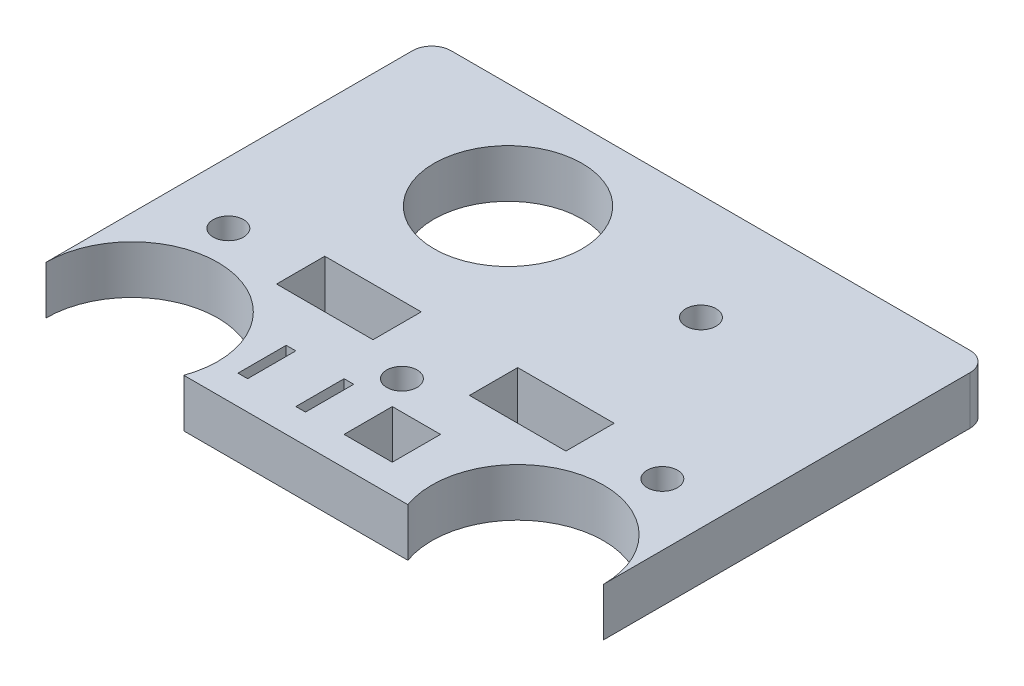
ISO-10303-21;
HEADER;
FILE_DESCRIPTION(('STEP AP214'),'2;1');
FILE_NAME('part.step','',(''),(''),'','','');
FILE_SCHEMA(('AUTOMOTIVE_DESIGN { 1 0 10303 214 1 1 1 1 }'));
ENDSEC;
DATA;
#1=APPLICATION_CONTEXT('core data for automotive mechanical design processes');
#2=APPLICATION_PROTOCOL_DEFINITION('international standard','automotive_design',2000,#1);
#3=PRODUCT_CONTEXT('',#1,'mechanical');
#4=PRODUCT('Part','Part','',(#3));
#5=PRODUCT_RELATED_PRODUCT_CATEGORY('part','',(#4));
#6=PRODUCT_DEFINITION_FORMATION('','',#4);
#7=PRODUCT_DEFINITION_CONTEXT('part definition',#1,'design');
#8=PRODUCT_DEFINITION('design','',#6,#7);
#9=PRODUCT_DEFINITION_SHAPE('','',#8);
#10=(LENGTH_UNIT() NAMED_UNIT(*) SI_UNIT(.MILLI.,.METRE.));
#11=(NAMED_UNIT(*) PLANE_ANGLE_UNIT() SI_UNIT($,.RADIAN.));
#12=(NAMED_UNIT(*) SI_UNIT($,.STERADIAN.) SOLID_ANGLE_UNIT());
#13=UNCERTAINTY_MEASURE_WITH_UNIT(LENGTH_MEASURE(1.E-05),#10,'distance_accuracy_value','');
#14=(GEOMETRIC_REPRESENTATION_CONTEXT(3) GLOBAL_UNCERTAINTY_ASSIGNED_CONTEXT((#13)) GLOBAL_UNIT_ASSIGNED_CONTEXT((#10,
#11,#12)) REPRESENTATION_CONTEXT('',''));
#15=CARTESIAN_POINT('',(0.,0.,0.));
#16=DIRECTION('',(0.,0.,1.));
#17=DIRECTION('',(1.,0.,0.));
#18=AXIS2_PLACEMENT_3D('',#15,#16,#17);
#19=CARTESIAN_POINT('',(-25.4,6.35,0.));
#20=DIRECTION('',(0.,-1.,0.));
#21=DIRECTION('',(0.,0.,1.));
#22=AXIS2_PLACEMENT_3D('',#19,#20,#21);
#23=CYLINDRICAL_SURFACE('',#22,11.309999986);
#24=CARTESIAN_POINT('',(-25.4,0.,0.));
#25=DIRECTION('',(0.,-1.,0.));
#26=DIRECTION('',(0.,0.,-1.));
#27=AXIS2_PLACEMENT_3D('',#24,#25,#26);
#28=CIRCLE('',#27,11.309999986);
#29=CARTESIAN_POINT('',(-36.709999986,0.,0.));
#30=VERTEX_POINT('',#29);
#31=CARTESIAN_POINT('',(-14.7510564052898,0.,3.81));
#32=VERTEX_POINT('',#31);
#33=EDGE_CURVE('E403',#30,#32,#28,.T.);
#34=ORIENTED_EDGE('',*,*,#33,.T.);
#35=DIRECTION('',(0.,-1.,0.));
#36=VECTOR('',#35,1.);
#37=CARTESIAN_POINT('',(-14.7510564052898,6.35,3.81));
#38=LINE('',#37,#36);
#39=CARTESIAN_POINT('',(-14.7510564052898,6.35,3.81));
#40=VERTEX_POINT('',#39);
#41=EDGE_CURVE('E427',#40,#32,#38,.T.);
#42=ORIENTED_EDGE('',*,*,#41,.F.);
#43=CARTESIAN_POINT('',(-25.4,6.35,0.));
#44=DIRECTION('',(0.,-1.,0.));
#45=DIRECTION('',(0.,0.,-1.));
#46=AXIS2_PLACEMENT_3D('',#43,#44,#45);
#47=CIRCLE('',#46,11.309999986);
#48=CARTESIAN_POINT('',(-36.709999986,6.35,0.));
#49=VERTEX_POINT('',#48);
#50=EDGE_CURVE('E409',#49,#40,#47,.T.);
#51=ORIENTED_EDGE('',*,*,#50,.F.);
#52=DIRECTION('',(0.,-1.,0.));
#53=VECTOR('',#52,1.);
#54=CARTESIAN_POINT('',(-36.709999986,6.35,0.));
#55=LINE('',#54,#53);
#56=EDGE_CURVE('E11',#49,#30,#55,.T.);
#57=ORIENTED_EDGE('',*,*,#56,.T.);
#58=EDGE_LOOP('',(#34,#42,#51,#57));
#59=FACE_BOUND('',#58,.T.);
#60=ADVANCED_FACE('F39',(#59),#23,.F.);
#61=CARTESIAN_POINT('',(-36.709999986,6.35,0.));
#62=DIRECTION('',(-1.,0.,0.));
#63=DIRECTION('',(0.,0.,-1.));
#64=AXIS2_PLACEMENT_3D('',#61,#62,#63);
#65=PLANE('',#64);
#66=DIRECTION('',(0.,0.,1.));
#67=VECTOR('',#66,1.);
#68=CARTESIAN_POINT('',(-36.709999986,0.,0.));
#69=LINE('',#68,#67);
#70=CARTESIAN_POINT('',(-36.709999986,0.,-48.26));
#71=VERTEX_POINT('',#70);
#72=EDGE_CURVE('E430',#71,#30,#69,.T.);
#73=ORIENTED_EDGE('',*,*,#72,.T.);
#74=ORIENTED_EDGE('',*,*,#56,.F.);
#75=DIRECTION('',(0.,0.,1.));
#76=VECTOR('',#75,1.);
#77=CARTESIAN_POINT('',(-36.709999986,6.35,0.));
#78=LINE('',#77,#76);
#79=CARTESIAN_POINT('',(-36.709999986,6.35,-48.26));
#80=VERTEX_POINT('',#79);
#81=EDGE_CURVE('E412',#80,#49,#78,.T.);
#82=ORIENTED_EDGE('',*,*,#81,.F.);
#83=DIRECTION('',(0.,-1.,0.));
#84=VECTOR('',#83,1.);
#85=CARTESIAN_POINT('',(-36.709999986,6.35,-48.26));
#86=LINE('',#85,#84);
#87=EDGE_CURVE('E46',#80,#71,#86,.T.);
#88=ORIENTED_EDGE('',*,*,#87,.T.);
#89=EDGE_LOOP('',(#73,#74,#82,#88));
#90=FACE_BOUND('',#89,.T.);
#91=ADVANCED_FACE('F464',(#90),#65,.T.);
#92=CARTESIAN_POINT('',(-34.169999986,6.35,-48.26));
#93=DIRECTION('',(0.,-1.,0.));
#94=DIRECTION('',(0.,0.,1.));
#95=AXIS2_PLACEMENT_3D('',#92,#93,#94);
#96=CYLINDRICAL_SURFACE('',#95,2.54);
#97=CARTESIAN_POINT('',(-34.169999986,0.,-48.26));
#98=DIRECTION('',(0.,-1.,0.));
#99=DIRECTION('',(0.,0.,-1.));
#100=AXIS2_PLACEMENT_3D('',#97,#98,#99);
#101=CIRCLE('',#100,2.54);
#102=CARTESIAN_POINT('',(-34.169999986,0.,-50.8));
#103=VERTEX_POINT('',#102);
#104=EDGE_CURVE('E432',#103,#71,#101,.F.);
#105=ORIENTED_EDGE('',*,*,#104,.T.);
#106=ORIENTED_EDGE('',*,*,#87,.F.);
#107=CARTESIAN_POINT('',(-34.169999986,6.35,-48.26));
#108=DIRECTION('',(0.,-1.,0.));
#109=DIRECTION('',(0.,0.,-1.));
#110=AXIS2_PLACEMENT_3D('',#107,#108,#109);
#111=CIRCLE('',#110,2.54);
#112=CARTESIAN_POINT('',(-34.169999986,6.35,-50.8));
#113=VERTEX_POINT('',#112);
#114=EDGE_CURVE('E415',#113,#80,#111,.F.);
#115=ORIENTED_EDGE('',*,*,#114,.F.);
#116=DIRECTION('',(0.,-1.,0.));
#117=VECTOR('',#116,1.);
#118=CARTESIAN_POINT('',(-34.169999986,6.35,-50.8));
#119=LINE('',#118,#117);
#120=EDGE_CURVE('E457',#113,#103,#119,.T.);
#121=ORIENTED_EDGE('',*,*,#120,.T.);
#122=EDGE_LOOP('',(#105,#106,#115,#121));
#123=FACE_BOUND('',#122,.T.);
#124=ADVANCED_FACE('F481',(#123),#96,.T.);
#125=CARTESIAN_POINT('',(0.,6.35,-50.8));
#126=DIRECTION('',(0.,0.,-1.));
#127=DIRECTION('',(1.,0.,0.));
#128=AXIS2_PLACEMENT_3D('',#125,#126,#127);
#129=PLANE('',#128);
#130=DIRECTION('',(-1.,0.,0.));
#131=VECTOR('',#130,1.);
#132=CARTESIAN_POINT('',(0.,0.,-50.8));
#133=LINE('',#132,#131);
#134=CARTESIAN_POINT('',(34.169999986,0.,-50.8));
#135=VERTEX_POINT('',#134);
#136=EDGE_CURVE('E434',#135,#103,#133,.T.);
#137=ORIENTED_EDGE('',*,*,#136,.T.);
#138=ORIENTED_EDGE('',*,*,#120,.F.);
#139=DIRECTION('',(-1.,0.,0.));
#140=VECTOR('',#139,1.);
#141=CARTESIAN_POINT('',(0.,6.35,-50.8));
#142=LINE('',#141,#140);
#143=CARTESIAN_POINT('',(34.169999986,6.35,-50.8));
#144=VERTEX_POINT('',#143);
#145=EDGE_CURVE('E417',#144,#113,#142,.T.);
#146=ORIENTED_EDGE('',*,*,#145,.F.);
#147=DIRECTION('',(0.,-1.,0.));
#148=VECTOR('',#147,1.);
#149=CARTESIAN_POINT('',(34.169999986,6.35,-50.8));
#150=LINE('',#149,#148);
#151=EDGE_CURVE('E454',#144,#135,#150,.T.);
#152=ORIENTED_EDGE('',*,*,#151,.T.);
#153=EDGE_LOOP('',(#137,#138,#146,#152));
#154=FACE_BOUND('',#153,.T.);
#155=ADVANCED_FACE('F483',(#154),#129,.T.);
#156=CARTESIAN_POINT('',(34.169999986,6.35,-48.26));
#157=DIRECTION('',(0.,-1.,0.));
#158=DIRECTION('',(0.,0.,1.));
#159=AXIS2_PLACEMENT_3D('',#156,#157,#158);
#160=CYLINDRICAL_SURFACE('',#159,2.54);
#161=CARTESIAN_POINT('',(34.169999986,0.,-48.26));
#162=DIRECTION('',(0.,-1.,0.));
#163=DIRECTION('',(0.,0.,-1.));
#164=AXIS2_PLACEMENT_3D('',#161,#162,#163);
#165=CIRCLE('',#164,2.54);
#166=CARTESIAN_POINT('',(36.709999986,0.,-48.26));
#167=VERTEX_POINT('',#166);
#168=EDGE_CURVE('E436',#167,#135,#165,.F.);
#169=ORIENTED_EDGE('',*,*,#168,.T.);
#170=ORIENTED_EDGE('',*,*,#151,.F.);
#171=CARTESIAN_POINT('',(34.169999986,6.35,-48.26));
#172=DIRECTION('',(0.,-1.,0.));
#173=DIRECTION('',(0.,0.,-1.));
#174=AXIS2_PLACEMENT_3D('',#171,#172,#173);
#175=CIRCLE('',#174,2.54);
#176=CARTESIAN_POINT('',(36.709999986,6.35,-48.26));
#177=VERTEX_POINT('',#176);
#178=EDGE_CURVE('E419',#177,#144,#175,.F.);
#179=ORIENTED_EDGE('',*,*,#178,.F.);
#180=DIRECTION('',(0.,-1.,0.));
#181=VECTOR('',#180,1.);
#182=CARTESIAN_POINT('',(36.709999986,6.35,-48.26));
#183=LINE('',#182,#181);
#184=EDGE_CURVE('E451',#177,#167,#183,.T.);
#185=ORIENTED_EDGE('',*,*,#184,.T.);
#186=EDGE_LOOP('',(#169,#170,#179,#185));
#187=FACE_BOUND('',#186,.T.);
#188=ADVANCED_FACE('F488',(#187),#160,.T.);
#189=CARTESIAN_POINT('',(36.709999986,6.35,0.));
#190=DIRECTION('',(1.,0.,0.));
#191=DIRECTION('',(0.,0.,1.));
#192=AXIS2_PLACEMENT_3D('',#189,#190,#191);
#193=PLANE('',#192);
#194=DIRECTION('',(0.,0.,-1.));
#195=VECTOR('',#194,1.);
#196=CARTESIAN_POINT('',(36.709999986,0.,0.));
#197=LINE('',#196,#195);
#198=CARTESIAN_POINT('',(36.709999986,0.,0.));
#199=VERTEX_POINT('',#198);
#200=EDGE_CURVE('E438',#199,#167,#197,.T.);
#201=ORIENTED_EDGE('',*,*,#200,.T.);
#202=ORIENTED_EDGE('',*,*,#184,.F.);
#203=DIRECTION('',(0.,0.,-1.));
#204=VECTOR('',#203,1.);
#205=CARTESIAN_POINT('',(36.709999986,6.35,0.));
#206=LINE('',#205,#204);
#207=CARTESIAN_POINT('',(36.709999986,6.35,0.));
#208=VERTEX_POINT('',#207);
#209=EDGE_CURVE('E421',#208,#177,#206,.T.);
#210=ORIENTED_EDGE('',*,*,#209,.F.);
#211=DIRECTION('',(0.,-1.,0.));
#212=VECTOR('',#211,1.);
#213=CARTESIAN_POINT('',(36.709999986,6.35,0.));
#214=LINE('',#213,#212);
#215=EDGE_CURVE('E448',#208,#199,#214,.T.);
#216=ORIENTED_EDGE('',*,*,#215,.T.);
#217=EDGE_LOOP('',(#201,#202,#210,#216));
#218=FACE_BOUND('',#217,.T.);
#219=ADVANCED_FACE('F493',(#218),#193,.T.);
#220=CARTESIAN_POINT('',(25.4,6.35,0.));
#221=DIRECTION('',(0.,-1.,0.));
#222=DIRECTION('',(0.,0.,1.));
#223=AXIS2_PLACEMENT_3D('',#220,#221,#222);
#224=CYLINDRICAL_SURFACE('',#223,11.309999986);
#225=CARTESIAN_POINT('',(25.4,0.,0.));
#226=DIRECTION('',(0.,-1.,0.));
#227=DIRECTION('',(0.,0.,-1.));
#228=AXIS2_PLACEMENT_3D('',#225,#226,#227);
#229=CIRCLE('',#228,11.309999986);
#230=CARTESIAN_POINT('',(14.7510564052898,0.,3.81));
#231=VERTEX_POINT('',#230);
#232=EDGE_CURVE('E440',#231,#199,#229,.T.);
#233=ORIENTED_EDGE('',*,*,#232,.T.);
#234=ORIENTED_EDGE('',*,*,#215,.F.);
#235=CARTESIAN_POINT('',(25.4,6.35,0.));
#236=DIRECTION('',(0.,-1.,0.));
#237=DIRECTION('',(0.,0.,-1.));
#238=AXIS2_PLACEMENT_3D('',#235,#236,#237);
#239=CIRCLE('',#238,11.309999986);
#240=CARTESIAN_POINT('',(14.7510564052898,6.35,3.81));
#241=VERTEX_POINT('',#240);
#242=EDGE_CURVE('E423',#241,#208,#239,.T.);
#243=ORIENTED_EDGE('',*,*,#242,.F.);
#244=DIRECTION('',(0.,-1.,0.));
#245=VECTOR('',#244,1.);
#246=CARTESIAN_POINT('',(14.7510564052898,6.35,3.81));
#247=LINE('',#246,#245);
#248=EDGE_CURVE('E445',#241,#231,#247,.T.);
#249=ORIENTED_EDGE('',*,*,#248,.T.);
#250=EDGE_LOOP('',(#233,#234,#243,#249));
#251=FACE_BOUND('',#250,.T.);
#252=ADVANCED_FACE('F497',(#251),#224,.F.);
#253=CARTESIAN_POINT('',(0.,6.35,3.81));
#254=DIRECTION('',(0.,0.,1.));
#255=DIRECTION('',(-1.,0.,0.));
#256=AXIS2_PLACEMENT_3D('',#253,#254,#255);
#257=PLANE('',#256);
#258=DIRECTION('',(1.,0.,0.));
#259=VECTOR('',#258,1.);
#260=CARTESIAN_POINT('',(0.,0.,3.81));
#261=LINE('',#260,#259);
#262=EDGE_CURVE('E413',#32,#231,#261,.T.);
#263=ORIENTED_EDGE('',*,*,#262,.T.);
#264=ORIENTED_EDGE('',*,*,#248,.F.);
#265=DIRECTION('',(1.,0.,0.));
#266=VECTOR('',#265,1.);
#267=CARTESIAN_POINT('',(0.,6.35,3.81));
#268=LINE('',#267,#266);
#269=EDGE_CURVE('E425',#40,#241,#268,.T.);
#270=ORIENTED_EDGE('',*,*,#269,.F.);
#271=ORIENTED_EDGE('',*,*,#41,.T.);
#272=EDGE_LOOP('',(#263,#264,#270,#271));
#273=FACE_BOUND('',#272,.T.);
#274=ADVANCED_FACE('F499',(#273),#257,.T.);
#275=CARTESIAN_POINT('',(0.,6.35,0.));
#276=DIRECTION('',(0.,1.,0.));
#277=DIRECTION('',(0.,0.,-1.));
#278=AXIS2_PLACEMENT_3D('',#275,#276,#277);
#279=PLANE('',#278);
#280=CARTESIAN_POINT('',(12.7,6.35,-36.83));
#281=DIRECTION('',(0.,-1.,0.));
#282=DIRECTION('',(0.,0.,-1.));
#283=AXIS2_PLACEMENT_3D('',#280,#281,#282);
#284=CIRCLE('',#283,2.);
#285=CARTESIAN_POINT('',(12.7,6.35,-38.83));
#286=VERTEX_POINT('',#285);
#287=EDGE_CURVE('E810',#286,#286,#284,.T.);
#288=ORIENTED_EDGE('',*,*,#287,.T.);
#289=EDGE_LOOP('',(#288));
#290=FACE_BOUND('',#289,.T.);
#291=CARTESIAN_POINT('',(-12.7,6.35,-36.83));
#292=DIRECTION('',(0.,-1.,0.));
#293=DIRECTION('',(0.,0.,-1.));
#294=AXIS2_PLACEMENT_3D('',#291,#292,#293);
#295=CIRCLE('',#294,9.75);
#296=CARTESIAN_POINT('',(-12.7,6.35,-46.58));
#297=VERTEX_POINT('',#296);
#298=EDGE_CURVE('E812',#297,#297,#295,.T.);
#299=ORIENTED_EDGE('',*,*,#298,.T.);
#300=EDGE_LOOP('',(#299));
#301=FACE_BOUND('',#300,.T.);
#302=DIRECTION('',(0.,0.,1.));
#303=VECTOR('',#302,1.);
#304=CARTESIAN_POINT('',(-10.16,6.35,0.));
#305=LINE('',#304,#303);
#306=CARTESIAN_POINT('',(-10.16,6.35,-6.35));
#307=VERTEX_POINT('',#306);
#308=CARTESIAN_POINT('',(-10.16,6.35,0.));
#309=VERTEX_POINT('',#308);
#310=EDGE_CURVE('E249',#307,#309,#305,.T.);
#311=ORIENTED_EDGE('',*,*,#310,.T.);
#312=DIRECTION('',(-1.,0.,0.));
#313=VECTOR('',#312,1.);
#314=CARTESIAN_POINT('',(-10.16,6.35,0.));
#315=LINE('',#314,#313);
#316=CARTESIAN_POINT('',(-11.43,6.35,0.));
#317=VERTEX_POINT('',#316);
#318=EDGE_CURVE('E228',#309,#317,#315,.T.);
#319=ORIENTED_EDGE('',*,*,#318,.T.);
#320=DIRECTION('',(0.,0.,-1.));
#321=VECTOR('',#320,1.);
#322=CARTESIAN_POINT('',(-11.43,6.35,0.));
#323=LINE('',#322,#321);
#324=CARTESIAN_POINT('',(-11.43,6.35,-6.35));
#325=VERTEX_POINT('',#324);
#326=EDGE_CURVE('E253',#317,#325,#323,.T.);
#327=ORIENTED_EDGE('',*,*,#326,.T.);
#328=DIRECTION('',(1.,0.,0.));
#329=VECTOR('',#328,1.);
#330=CARTESIAN_POINT('',(-10.16,6.35,-6.35));
#331=LINE('',#330,#329);
#332=EDGE_CURVE('E239',#325,#307,#331,.T.);
#333=ORIENTED_EDGE('',*,*,#332,.T.);
#334=EDGE_LOOP('',(#311,#319,#327,#333));
#335=FACE_BOUND('',#334,.T.);
#336=DIRECTION('',(0.,0.,1.));
#337=VECTOR('',#336,1.);
#338=CARTESIAN_POINT('',(-2.54,6.35,0.));
#339=LINE('',#338,#337);
#340=CARTESIAN_POINT('',(-2.54,6.35,-6.35));
#341=VERTEX_POINT('',#340);
#342=CARTESIAN_POINT('',(-2.54,6.35,0.));
#343=VERTEX_POINT('',#342);
#344=EDGE_CURVE('E259',#341,#343,#339,.T.);
#345=ORIENTED_EDGE('',*,*,#344,.T.);
#346=DIRECTION('',(-1.,0.,0.));
#347=VECTOR('',#346,1.);
#348=CARTESIAN_POINT('',(-2.54,6.35,0.));
#349=LINE('',#348,#347);
#350=CARTESIAN_POINT('',(-3.81,6.35,0.));
#351=VERTEX_POINT('',#350);
#352=EDGE_CURVE('E279',#343,#351,#349,.T.);
#353=ORIENTED_EDGE('',*,*,#352,.T.);
#354=DIRECTION('',(0.,0.,-1.));
#355=VECTOR('',#354,1.);
#356=CARTESIAN_POINT('',(-3.81,6.35,0.));
#357=LINE('',#356,#355);
#358=CARTESIAN_POINT('',(-3.81,6.35,-6.35));
#359=VERTEX_POINT('',#358);
#360=EDGE_CURVE('E282',#351,#359,#357,.T.);
#361=ORIENTED_EDGE('',*,*,#360,.T.);
#362=DIRECTION('',(1.,0.,0.));
#363=VECTOR('',#362,1.);
#364=CARTESIAN_POINT('',(-2.54,6.35,-6.35));
#365=LINE('',#364,#363);
#366=EDGE_CURVE('E267',#359,#341,#365,.T.);
#367=ORIENTED_EDGE('',*,*,#366,.T.);
#368=EDGE_LOOP('',(#345,#353,#361,#367));
#369=FACE_BOUND('',#368,.T.);
#370=DIRECTION('',(0.,0.,-1.));
#371=VECTOR('',#370,1.);
#372=CARTESIAN_POINT('',(2.54,6.35,0.));
#373=LINE('',#372,#371);
#374=CARTESIAN_POINT('',(2.54,6.35,0.));
#375=VERTEX_POINT('',#374);
#376=CARTESIAN_POINT('',(2.54,6.35,-6.35));
#377=VERTEX_POINT('',#376);
#378=EDGE_CURVE('E289',#375,#377,#373,.T.);
#379=ORIENTED_EDGE('',*,*,#378,.T.);
#380=DIRECTION('',(1.,0.,0.));
#381=VECTOR('',#380,1.);
#382=CARTESIAN_POINT('',(2.54,6.35,-6.35));
#383=LINE('',#382,#381);
#384=CARTESIAN_POINT('',(8.89,6.35,-6.35));
#385=VERTEX_POINT('',#384);
#386=EDGE_CURVE('E311',#377,#385,#383,.T.);
#387=ORIENTED_EDGE('',*,*,#386,.T.);
#388=DIRECTION('',(0.,0.,1.));
#389=VECTOR('',#388,1.);
#390=CARTESIAN_POINT('',(8.89,6.35,0.));
#391=LINE('',#390,#389);
#392=CARTESIAN_POINT('',(8.89,6.35,0.));
#393=VERTEX_POINT('',#392);
#394=EDGE_CURVE('E314',#385,#393,#391,.T.);
#395=ORIENTED_EDGE('',*,*,#394,.T.);
#396=DIRECTION('',(-1.,0.,0.));
#397=VECTOR('',#396,1.);
#398=CARTESIAN_POINT('',(2.54,6.35,0.));
#399=LINE('',#398,#397);
#400=EDGE_CURVE('E299',#393,#375,#399,.T.);
#401=ORIENTED_EDGE('',*,*,#400,.T.);
#402=EDGE_LOOP('',(#379,#387,#395,#401));
#403=FACE_BOUND('',#402,.T.);
#404=CARTESIAN_POINT('',(28.575,6.35,-15.875));
#405=DIRECTION('',(0.,-1.,0.));
#406=DIRECTION('',(0.,0.,1.));
#407=AXIS2_PLACEMENT_3D('',#404,#405,#406);
#408=CIRCLE('',#407,2.);
#409=CARTESIAN_POINT('',(28.575,6.35,-13.875));
#410=VERTEX_POINT('',#409);
#411=EDGE_CURVE('E321',#410,#410,#408,.T.);
#412=ORIENTED_EDGE('',*,*,#411,.T.);
#413=EDGE_LOOP('',(#412));
#414=FACE_BOUND('',#413,.T.);
#415=CARTESIAN_POINT('',(-28.575,6.35,-15.875));
#416=DIRECTION('',(0.,-1.,0.));
#417=DIRECTION('',(0.,0.,-1.));
#418=AXIS2_PLACEMENT_3D('',#415,#416,#417);
#419=CIRCLE('',#418,2.);
#420=CARTESIAN_POINT('',(-28.575,6.35,-17.875));
#421=VERTEX_POINT('',#420);
#422=EDGE_CURVE('E330',#421,#421,#419,.T.);
#423=ORIENTED_EDGE('',*,*,#422,.T.);
#424=EDGE_LOOP('',(#423));
#425=FACE_BOUND('',#424,.T.);
#426=CARTESIAN_POINT('',(0.,6.35,-10.16));
#427=DIRECTION('',(0.,-1.,0.));
#428=DIRECTION('',(0.,0.,-1.));
#429=AXIS2_PLACEMENT_3D('',#426,#427,#428);
#430=CIRCLE('',#429,2.);
#431=CARTESIAN_POINT('',(0.,6.35,-12.16));
#432=VERTEX_POINT('',#431);
#433=EDGE_CURVE('E336',#432,#432,#430,.T.);
#434=ORIENTED_EDGE('',*,*,#433,.T.);
#435=EDGE_LOOP('',(#434));
#436=FACE_BOUND('',#435,.T.);
#437=DIRECTION('',(0.,0.,-1.));
#438=VECTOR('',#437,1.);
#439=CARTESIAN_POINT('',(6.35,6.35,-12.7));
#440=LINE('',#439,#438);
#441=CARTESIAN_POINT('',(6.35,6.35,-12.7));
#442=VERTEX_POINT('',#441);
#443=CARTESIAN_POINT('',(6.35,6.35,-19.05));
#444=VERTEX_POINT('',#443);
#445=EDGE_CURVE('E342',#442,#444,#440,.T.);
#446=ORIENTED_EDGE('',*,*,#445,.T.);
#447=DIRECTION('',(1.,0.,0.));
#448=VECTOR('',#447,1.);
#449=CARTESIAN_POINT('',(6.35,6.35,-19.05));
#450=LINE('',#449,#448);
#451=CARTESIAN_POINT('',(19.05,6.35,-19.05));
#452=VERTEX_POINT('',#451);
#453=EDGE_CURVE('E361',#444,#452,#450,.T.);
#454=ORIENTED_EDGE('',*,*,#453,.T.);
#455=DIRECTION('',(0.,0.,1.));
#456=VECTOR('',#455,1.);
#457=CARTESIAN_POINT('',(19.05,6.35,-12.7));
#458=LINE('',#457,#456);
#459=CARTESIAN_POINT('',(19.05,6.35,-12.7));
#460=VERTEX_POINT('',#459);
#461=EDGE_CURVE('E364',#452,#460,#458,.T.);
#462=ORIENTED_EDGE('',*,*,#461,.T.);
#463=DIRECTION('',(-1.,0.,0.));
#464=VECTOR('',#463,1.);
#465=CARTESIAN_POINT('',(6.35,6.35,-12.7));
#466=LINE('',#465,#464);
#467=EDGE_CURVE('E349',#460,#442,#466,.T.);
#468=ORIENTED_EDGE('',*,*,#467,.T.);
#469=EDGE_LOOP('',(#446,#454,#462,#468));
#470=FACE_BOUND('',#469,.T.);
#471=DIRECTION('',(0.,0.,1.));
#472=VECTOR('',#471,1.);
#473=CARTESIAN_POINT('',(-6.35,6.35,-12.7));
#474=LINE('',#473,#472);
#475=CARTESIAN_POINT('',(-6.35,6.35,-19.05));
#476=VERTEX_POINT('',#475);
#477=CARTESIAN_POINT('',(-6.35,6.35,-12.7));
#478=VERTEX_POINT('',#477);
#479=EDGE_CURVE('E371',#476,#478,#474,.T.);
#480=ORIENTED_EDGE('',*,*,#479,.T.);
#481=DIRECTION('',(-1.,0.,0.));
#482=VECTOR('',#481,1.);
#483=CARTESIAN_POINT('',(-6.35,6.35,-12.7));
#484=LINE('',#483,#482);
#485=CARTESIAN_POINT('',(-19.05,6.35,-12.7));
#486=VERTEX_POINT('',#485);
#487=EDGE_CURVE('E393',#478,#486,#484,.T.);
#488=ORIENTED_EDGE('',*,*,#487,.T.);
#489=DIRECTION('',(0.,0.,-1.));
#490=VECTOR('',#489,1.);
#491=CARTESIAN_POINT('',(-19.05,6.35,-12.7));
#492=LINE('',#491,#490);
#493=CARTESIAN_POINT('',(-19.05,6.35,-19.05));
#494=VERTEX_POINT('',#493);
#495=EDGE_CURVE('E396',#486,#494,#492,.T.);
#496=ORIENTED_EDGE('',*,*,#495,.T.);
#497=DIRECTION('',(1.,0.,0.));
#498=VECTOR('',#497,1.);
#499=CARTESIAN_POINT('',(-6.35,6.35,-19.05));
#500=LINE('',#499,#498);
#501=EDGE_CURVE('E381',#494,#476,#500,.T.);
#502=ORIENTED_EDGE('',*,*,#501,.T.);
#503=EDGE_LOOP('',(#480,#488,#496,#502));
#504=FACE_BOUND('',#503,.T.);
#505=ORIENTED_EDGE('',*,*,#50,.T.);
#506=ORIENTED_EDGE('',*,*,#269,.T.);
#507=ORIENTED_EDGE('',*,*,#242,.T.);
#508=ORIENTED_EDGE('',*,*,#209,.T.);
#509=ORIENTED_EDGE('',*,*,#178,.T.);
#510=ORIENTED_EDGE('',*,*,#145,.T.);
#511=ORIENTED_EDGE('',*,*,#114,.T.);
#512=ORIENTED_EDGE('',*,*,#81,.T.);
#513=EDGE_LOOP('',(#505,#506,#507,#508,#509,#510,#511,#512));
#514=FACE_BOUND('',#513,.T.);
#515=ADVANCED_FACE('F477',(#290,#301,#335,#369,#403,#414,#425,#436,#470,#504,#514),#279,.T.);
#516=CARTESIAN_POINT('',(0.,0.,0.));
#517=DIRECTION('',(0.,1.,0.));
#518=DIRECTION('',(0.,0.,-1.));
#519=AXIS2_PLACEMENT_3D('',#516,#517,#518);
#520=PLANE('',#519);
#521=CARTESIAN_POINT('',(12.7,0.,-36.83));
#522=DIRECTION('',(0.,-1.,0.));
#523=DIRECTION('',(0.,0.,-1.));
#524=AXIS2_PLACEMENT_3D('',#521,#522,#523);
#525=CIRCLE('',#524,2.);
#526=CARTESIAN_POINT('',(12.7,0.,-38.83));
#527=VERTEX_POINT('',#526);
#528=EDGE_CURVE('E807',#527,#527,#525,.T.);
#529=ORIENTED_EDGE('',*,*,#528,.F.);
#530=EDGE_LOOP('',(#529));
#531=FACE_BOUND('',#530,.T.);
#532=CARTESIAN_POINT('',(-12.7,0.,-36.83));
#533=DIRECTION('',(0.,-1.,0.));
#534=DIRECTION('',(0.,0.,-1.));
#535=AXIS2_PLACEMENT_3D('',#532,#533,#534);
#536=CIRCLE('',#535,9.75);
#537=CARTESIAN_POINT('',(-12.7,0.,-46.58));
#538=VERTEX_POINT('',#537);
#539=EDGE_CURVE('E251',#538,#538,#536,.T.);
#540=ORIENTED_EDGE('',*,*,#539,.F.);
#541=EDGE_LOOP('',(#540));
#542=FACE_BOUND('',#541,.T.);
#543=DIRECTION('',(1.,0.,0.));
#544=VECTOR('',#543,1.);
#545=CARTESIAN_POINT('',(-10.16,0.,-6.35));
#546=LINE('',#545,#544);
#547=CARTESIAN_POINT('',(-11.43,0.,-6.35));
#548=VERTEX_POINT('',#547);
#549=CARTESIAN_POINT('',(-10.16,0.,-6.35));
#550=VERTEX_POINT('',#549);
#551=EDGE_CURVE('E230',#548,#550,#546,.T.);
#552=ORIENTED_EDGE('',*,*,#551,.F.);
#553=DIRECTION('',(0.,0.,-1.));
#554=VECTOR('',#553,1.);
#555=CARTESIAN_POINT('',(-11.43,0.,0.));
#556=LINE('',#555,#554);
#557=CARTESIAN_POINT('',(-11.43,0.,0.));
#558=VERTEX_POINT('',#557);
#559=EDGE_CURVE('E243',#558,#548,#556,.T.);
#560=ORIENTED_EDGE('',*,*,#559,.F.);
#561=DIRECTION('',(-1.,0.,0.));
#562=VECTOR('',#561,1.);
#563=CARTESIAN_POINT('',(-10.16,0.,0.));
#564=LINE('',#563,#562);
#565=CARTESIAN_POINT('',(-10.16,0.,0.));
#566=VERTEX_POINT('',#565);
#567=EDGE_CURVE('E225',#566,#558,#564,.T.);
#568=ORIENTED_EDGE('',*,*,#567,.F.);
#569=DIRECTION('',(0.,0.,1.));
#570=VECTOR('',#569,1.);
#571=CARTESIAN_POINT('',(-10.16,0.,0.));
#572=LINE('',#571,#570);
#573=EDGE_CURVE('E233',#550,#566,#572,.T.);
#574=ORIENTED_EDGE('',*,*,#573,.F.);
#575=EDGE_LOOP('',(#552,#560,#568,#574));
#576=FACE_BOUND('',#575,.T.);
#577=DIRECTION('',(1.,0.,0.));
#578=VECTOR('',#577,1.);
#579=CARTESIAN_POINT('',(-2.54,0.,-6.35));
#580=LINE('',#579,#578);
#581=CARTESIAN_POINT('',(-3.81,0.,-6.35));
#582=VERTEX_POINT('',#581);
#583=CARTESIAN_POINT('',(-2.54,0.,-6.35));
#584=VERTEX_POINT('',#583);
#585=EDGE_CURVE('E273',#582,#584,#580,.T.);
#586=ORIENTED_EDGE('',*,*,#585,.F.);
#587=DIRECTION('',(0.,0.,-1.));
#588=VECTOR('',#587,1.);
#589=CARTESIAN_POINT('',(-3.81,0.,0.));
#590=LINE('',#589,#588);
#591=CARTESIAN_POINT('',(-3.81,0.,0.));
#592=VERTEX_POINT('',#591);
#593=EDGE_CURVE('E270',#592,#582,#590,.T.);
#594=ORIENTED_EDGE('',*,*,#593,.F.);
#595=DIRECTION('',(-1.,0.,0.));
#596=VECTOR('',#595,1.);
#597=CARTESIAN_POINT('',(-2.54,0.,0.));
#598=LINE('',#597,#596);
#599=CARTESIAN_POINT('',(-2.54,0.,0.));
#600=VERTEX_POINT('',#599);
#601=EDGE_CURVE('E266',#600,#592,#598,.T.);
#602=ORIENTED_EDGE('',*,*,#601,.F.);
#603=DIRECTION('',(0.,0.,1.));
#604=VECTOR('',#603,1.);
#605=CARTESIAN_POINT('',(-2.54,0.,0.));
#606=LINE('',#605,#604);
#607=EDGE_CURVE('E263',#584,#600,#606,.T.);
#608=ORIENTED_EDGE('',*,*,#607,.F.);
#609=EDGE_LOOP('',(#586,#594,#602,#608));
#610=FACE_BOUND('',#609,.T.);
#611=DIRECTION('',(-1.,0.,0.));
#612=VECTOR('',#611,1.);
#613=CARTESIAN_POINT('',(2.54,0.,0.));
#614=LINE('',#613,#612);
#615=CARTESIAN_POINT('',(8.89,0.,0.));
#616=VERTEX_POINT('',#615);
#617=CARTESIAN_POINT('',(2.54,0.,0.));
#618=VERTEX_POINT('',#617);
#619=EDGE_CURVE('E305',#616,#618,#614,.T.);
#620=ORIENTED_EDGE('',*,*,#619,.F.);
#621=DIRECTION('',(0.,0.,1.));
#622=VECTOR('',#621,1.);
#623=CARTESIAN_POINT('',(8.89,0.,0.));
#624=LINE('',#623,#622);
#625=CARTESIAN_POINT('',(8.89,0.,-6.35));
#626=VERTEX_POINT('',#625);
#627=EDGE_CURVE('E302',#626,#616,#624,.T.);
#628=ORIENTED_EDGE('',*,*,#627,.F.);
#629=DIRECTION('',(1.,0.,0.));
#630=VECTOR('',#629,1.);
#631=CARTESIAN_POINT('',(2.54,0.,-6.35));
#632=LINE('',#631,#630);
#633=CARTESIAN_POINT('',(2.54,0.,-6.35));
#634=VERTEX_POINT('',#633);
#635=EDGE_CURVE('E298',#634,#626,#632,.T.);
#636=ORIENTED_EDGE('',*,*,#635,.F.);
#637=DIRECTION('',(0.,0.,-1.));
#638=VECTOR('',#637,1.);
#639=CARTESIAN_POINT('',(2.54,0.,0.));
#640=LINE('',#639,#638);
#641=EDGE_CURVE('E295',#618,#634,#640,.T.);
#642=ORIENTED_EDGE('',*,*,#641,.F.);
#643=EDGE_LOOP('',(#620,#628,#636,#642));
#644=FACE_BOUND('',#643,.T.);
#645=CARTESIAN_POINT('',(28.575,0.,-15.875));
#646=DIRECTION('',(0.,-1.,0.));
#647=DIRECTION('',(0.,0.,1.));
#648=AXIS2_PLACEMENT_3D('',#645,#646,#647);
#649=CIRCLE('',#648,2.);
#650=CARTESIAN_POINT('',(28.575,0.,-13.875));
#651=VERTEX_POINT('',#650);
#652=EDGE_CURVE('E327',#651,#651,#649,.T.);
#653=ORIENTED_EDGE('',*,*,#652,.F.);
#654=EDGE_LOOP('',(#653));
#655=FACE_BOUND('',#654,.T.);
#656=CARTESIAN_POINT('',(-28.575,0.,-15.875));
#657=DIRECTION('',(0.,-1.,0.));
#658=DIRECTION('',(0.,0.,-1.));
#659=AXIS2_PLACEMENT_3D('',#656,#657,#658);
#660=CIRCLE('',#659,2.);
#661=CARTESIAN_POINT('',(-28.575,0.,-17.875));
#662=VERTEX_POINT('',#661);
#663=EDGE_CURVE('E333',#662,#662,#660,.T.);
#664=ORIENTED_EDGE('',*,*,#663,.F.);
#665=EDGE_LOOP('',(#664));
#666=FACE_BOUND('',#665,.T.);
#667=CARTESIAN_POINT('',(0.,0.,-10.16));
#668=DIRECTION('',(0.,-1.,0.));
#669=DIRECTION('',(0.,0.,-1.));
#670=AXIS2_PLACEMENT_3D('',#667,#668,#669);
#671=CIRCLE('',#670,2.);
#672=CARTESIAN_POINT('',(0.,0.,-12.16));
#673=VERTEX_POINT('',#672);
#674=EDGE_CURVE('E339',#673,#673,#671,.T.);
#675=ORIENTED_EDGE('',*,*,#674,.F.);
#676=EDGE_LOOP('',(#675));
#677=FACE_BOUND('',#676,.T.);
#678=DIRECTION('',(-1.,0.,0.));
#679=VECTOR('',#678,1.);
#680=CARTESIAN_POINT('',(6.35,0.,-12.7));
#681=LINE('',#680,#679);
#682=CARTESIAN_POINT('',(19.05,0.,-12.7));
#683=VERTEX_POINT('',#682);
#684=CARTESIAN_POINT('',(6.35,0.,-12.7));
#685=VERTEX_POINT('',#684);
#686=EDGE_CURVE('E355',#683,#685,#681,.T.);
#687=ORIENTED_EDGE('',*,*,#686,.F.);
#688=DIRECTION('',(0.,0.,1.));
#689=VECTOR('',#688,1.);
#690=CARTESIAN_POINT('',(19.05,0.,-12.7));
#691=LINE('',#690,#689);
#692=CARTESIAN_POINT('',(19.05,0.,-19.05));
#693=VERTEX_POINT('',#692);
#694=EDGE_CURVE('E352',#693,#683,#691,.T.);
#695=ORIENTED_EDGE('',*,*,#694,.F.);
#696=DIRECTION('',(1.,0.,0.));
#697=VECTOR('',#696,1.);
#698=CARTESIAN_POINT('',(6.35,0.,-19.05));
#699=LINE('',#698,#697);
#700=CARTESIAN_POINT('',(6.35,0.,-19.05));
#701=VERTEX_POINT('',#700);
#702=EDGE_CURVE('E348',#701,#693,#699,.T.);
#703=ORIENTED_EDGE('',*,*,#702,.F.);
#704=DIRECTION('',(0.,0.,-1.));
#705=VECTOR('',#704,1.);
#706=CARTESIAN_POINT('',(6.35,0.,-12.7));
#707=LINE('',#706,#705);
#708=EDGE_CURVE('E345',#685,#701,#707,.T.);
#709=ORIENTED_EDGE('',*,*,#708,.F.);
#710=EDGE_LOOP('',(#687,#695,#703,#709));
#711=FACE_BOUND('',#710,.T.);
#712=DIRECTION('',(1.,0.,0.));
#713=VECTOR('',#712,1.);
#714=CARTESIAN_POINT('',(-6.35,0.,-19.05));
#715=LINE('',#714,#713);
#716=CARTESIAN_POINT('',(-19.05,0.,-19.05));
#717=VERTEX_POINT('',#716);
#718=CARTESIAN_POINT('',(-6.35,0.,-19.05));
#719=VERTEX_POINT('',#718);
#720=EDGE_CURVE('E387',#717,#719,#715,.T.);
#721=ORIENTED_EDGE('',*,*,#720,.F.);
#722=DIRECTION('',(0.,0.,-1.));
#723=VECTOR('',#722,1.);
#724=CARTESIAN_POINT('',(-19.05,0.,-12.7));
#725=LINE('',#724,#723);
#726=CARTESIAN_POINT('',(-19.05,0.,-12.7));
#727=VERTEX_POINT('',#726);
#728=EDGE_CURVE('E384',#727,#717,#725,.T.);
#729=ORIENTED_EDGE('',*,*,#728,.F.);
#730=DIRECTION('',(-1.,0.,0.));
#731=VECTOR('',#730,1.);
#732=CARTESIAN_POINT('',(-6.35,0.,-12.7));
#733=LINE('',#732,#731);
#734=CARTESIAN_POINT('',(-6.35,0.,-12.7));
#735=VERTEX_POINT('',#734);
#736=EDGE_CURVE('E380',#735,#727,#733,.T.);
#737=ORIENTED_EDGE('',*,*,#736,.F.);
#738=DIRECTION('',(0.,0.,1.));
#739=VECTOR('',#738,1.);
#740=CARTESIAN_POINT('',(-6.35,0.,-12.7));
#741=LINE('',#740,#739);
#742=EDGE_CURVE('E377',#719,#735,#741,.T.);
#743=ORIENTED_EDGE('',*,*,#742,.F.);
#744=EDGE_LOOP('',(#721,#729,#737,#743));
#745=FACE_BOUND('',#744,.T.);
#746=ORIENTED_EDGE('',*,*,#33,.F.);
#747=ORIENTED_EDGE('',*,*,#72,.F.);
#748=ORIENTED_EDGE('',*,*,#104,.F.);
#749=ORIENTED_EDGE('',*,*,#136,.F.);
#750=ORIENTED_EDGE('',*,*,#168,.F.);
#751=ORIENTED_EDGE('',*,*,#200,.F.);
#752=ORIENTED_EDGE('',*,*,#232,.F.);
#753=ORIENTED_EDGE('',*,*,#262,.F.);
#754=EDGE_LOOP('',(#746,#747,#748,#749,#750,#751,#752,#753));
#755=FACE_BOUND('',#754,.T.);
#756=ADVANCED_FACE('F241',(#531,#542,#576,#610,#644,#655,#666,#677,#711,#745,#755),#520,.F.);
#757=CARTESIAN_POINT('',(-6.35,0.,-12.7));
#758=DIRECTION('',(1.,0.,0.));
#759=DIRECTION('',(0.,0.,1.));
#760=AXIS2_PLACEMENT_3D('',#757,#758,#759);
#761=PLANE('',#760);
#762=ORIENTED_EDGE('',*,*,#479,.F.);
#763=DIRECTION('',(0.,1.,0.));
#764=VECTOR('',#763,1.);
#765=CARTESIAN_POINT('',(-6.35,0.,-19.05));
#766=LINE('',#765,#764);
#767=EDGE_CURVE('E401',#719,#476,#766,.T.);
#768=ORIENTED_EDGE('',*,*,#767,.F.);
#769=ORIENTED_EDGE('',*,*,#742,.T.);
#770=DIRECTION('',(0.,1.,0.));
#771=VECTOR('',#770,1.);
#772=CARTESIAN_POINT('',(-6.35,0.,-12.7));
#773=LINE('',#772,#771);
#774=EDGE_CURVE('E390',#735,#478,#773,.T.);
#775=ORIENTED_EDGE('',*,*,#774,.T.);
#776=EDGE_LOOP('',(#762,#768,#769,#775));
#777=FACE_BOUND('',#776,.T.);
#778=ADVANCED_FACE('F556',(#777),#761,.F.);
#779=CARTESIAN_POINT('',(-6.35,0.,-19.05));
#780=DIRECTION('',(0.,0.,-1.));
#781=DIRECTION('',(1.,0.,0.));
#782=AXIS2_PLACEMENT_3D('',#779,#780,#781);
#783=PLANE('',#782);
#784=ORIENTED_EDGE('',*,*,#501,.F.);
#785=DIRECTION('',(0.,1.,0.));
#786=VECTOR('',#785,1.);
#787=CARTESIAN_POINT('',(-19.05,0.,-19.05));
#788=LINE('',#787,#786);
#789=EDGE_CURVE('E404',#717,#494,#788,.T.);
#790=ORIENTED_EDGE('',*,*,#789,.F.);
#791=ORIENTED_EDGE('',*,*,#720,.T.);
#792=ORIENTED_EDGE('',*,*,#767,.T.);
#793=EDGE_LOOP('',(#784,#790,#791,#792));
#794=FACE_BOUND('',#793,.T.);
#795=ADVANCED_FACE('F565',(#794),#783,.F.);
#796=CARTESIAN_POINT('',(-19.05,0.,-12.7));
#797=DIRECTION('',(-1.,0.,0.));
#798=DIRECTION('',(0.,0.,-1.));
#799=AXIS2_PLACEMENT_3D('',#796,#797,#798);
#800=PLANE('',#799);
#801=ORIENTED_EDGE('',*,*,#495,.F.);
#802=DIRECTION('',(0.,1.,0.));
#803=VECTOR('',#802,1.);
#804=CARTESIAN_POINT('',(-19.05,0.,-12.7));
#805=LINE('',#804,#803);
#806=EDGE_CURVE('E406',#727,#486,#805,.T.);
#807=ORIENTED_EDGE('',*,*,#806,.F.);
#808=ORIENTED_EDGE('',*,*,#728,.T.);
#809=ORIENTED_EDGE('',*,*,#789,.T.);
#810=EDGE_LOOP('',(#801,#807,#808,#809));
#811=FACE_BOUND('',#810,.T.);
#812=ADVANCED_FACE('F575',(#811),#800,.F.);
#813=CARTESIAN_POINT('',(-6.35,0.,-12.7));
#814=DIRECTION('',(0.,0.,1.));
#815=DIRECTION('',(-1.,0.,0.));
#816=AXIS2_PLACEMENT_3D('',#813,#814,#815);
#817=PLANE('',#816);
#818=ORIENTED_EDGE('',*,*,#487,.F.);
#819=ORIENTED_EDGE('',*,*,#774,.F.);
#820=ORIENTED_EDGE('',*,*,#736,.T.);
#821=ORIENTED_EDGE('',*,*,#806,.T.);
#822=EDGE_LOOP('',(#818,#819,#820,#821));
#823=FACE_BOUND('',#822,.T.);
#824=ADVANCED_FACE('F585',(#823),#817,.F.);
#825=CARTESIAN_POINT('',(6.35,0.,-12.7));
#826=DIRECTION('',(-1.,0.,0.));
#827=DIRECTION('',(0.,0.,-1.));
#828=AXIS2_PLACEMENT_3D('',#825,#826,#827);
#829=PLANE('',#828);
#830=ORIENTED_EDGE('',*,*,#445,.F.);
#831=DIRECTION('',(0.,1.,0.));
#832=VECTOR('',#831,1.);
#833=CARTESIAN_POINT('',(6.35,0.,-12.7));
#834=LINE('',#833,#832);
#835=EDGE_CURVE('E369',#685,#442,#834,.T.);
#836=ORIENTED_EDGE('',*,*,#835,.F.);
#837=ORIENTED_EDGE('',*,*,#708,.T.);
#838=DIRECTION('',(0.,1.,0.));
#839=VECTOR('',#838,1.);
#840=CARTESIAN_POINT('',(6.35,0.,-19.05));
#841=LINE('',#840,#839);
#842=EDGE_CURVE('E358',#701,#444,#841,.T.);
#843=ORIENTED_EDGE('',*,*,#842,.T.);
#844=EDGE_LOOP('',(#830,#836,#837,#843));
#845=FACE_BOUND('',#844,.T.);
#846=ADVANCED_FACE('F595',(#845),#829,.F.);
#847=CARTESIAN_POINT('',(6.35,0.,-12.7));
#848=DIRECTION('',(0.,0.,1.));
#849=DIRECTION('',(-1.,0.,0.));
#850=AXIS2_PLACEMENT_3D('',#847,#848,#849);
#851=PLANE('',#850);
#852=ORIENTED_EDGE('',*,*,#467,.F.);
#853=DIRECTION('',(0.,1.,0.));
#854=VECTOR('',#853,1.);
#855=CARTESIAN_POINT('',(19.05,0.,-12.7));
#856=LINE('',#855,#854);
#857=EDGE_CURVE('E372',#683,#460,#856,.T.);
#858=ORIENTED_EDGE('',*,*,#857,.F.);
#859=ORIENTED_EDGE('',*,*,#686,.T.);
#860=ORIENTED_EDGE('',*,*,#835,.T.);
#861=EDGE_LOOP('',(#852,#858,#859,#860));
#862=FACE_BOUND('',#861,.T.);
#863=ADVANCED_FACE('F605',(#862),#851,.F.);
#864=CARTESIAN_POINT('',(19.05,0.,-12.7));
#865=DIRECTION('',(1.,0.,0.));
#866=DIRECTION('',(0.,0.,1.));
#867=AXIS2_PLACEMENT_3D('',#864,#865,#866);
#868=PLANE('',#867);
#869=ORIENTED_EDGE('',*,*,#461,.F.);
#870=DIRECTION('',(0.,1.,0.));
#871=VECTOR('',#870,1.);
#872=CARTESIAN_POINT('',(19.05,0.,-19.05));
#873=LINE('',#872,#871);
#874=EDGE_CURVE('E374',#693,#452,#873,.T.);
#875=ORIENTED_EDGE('',*,*,#874,.F.);
#876=ORIENTED_EDGE('',*,*,#694,.T.);
#877=ORIENTED_EDGE('',*,*,#857,.T.);
#878=EDGE_LOOP('',(#869,#875,#876,#877));
#879=FACE_BOUND('',#878,.T.);
#880=ADVANCED_FACE('F615',(#879),#868,.F.);
#881=CARTESIAN_POINT('',(6.35,0.,-19.05));
#882=DIRECTION('',(0.,0.,-1.));
#883=DIRECTION('',(1.,0.,0.));
#884=AXIS2_PLACEMENT_3D('',#881,#882,#883);
#885=PLANE('',#884);
#886=ORIENTED_EDGE('',*,*,#453,.F.);
#887=ORIENTED_EDGE('',*,*,#842,.F.);
#888=ORIENTED_EDGE('',*,*,#702,.T.);
#889=ORIENTED_EDGE('',*,*,#874,.T.);
#890=EDGE_LOOP('',(#886,#887,#888,#889));
#891=FACE_BOUND('',#890,.T.);
#892=ADVANCED_FACE('F625',(#891),#885,.F.);
#893=CARTESIAN_POINT('',(0.,0.,-10.16));
#894=DIRECTION('',(0.,1.,0.));
#895=DIRECTION('',(0.,0.,-1.));
#896=AXIS2_PLACEMENT_3D('',#893,#894,#895);
#897=CYLINDRICAL_SURFACE('',#896,2.);
#898=ORIENTED_EDGE('',*,*,#674,.T.);
#899=EDGE_LOOP('',(#898));
#900=FACE_BOUND('',#899,.T.);
#901=ORIENTED_EDGE('',*,*,#433,.F.);
#902=EDGE_LOOP('',(#901));
#903=FACE_BOUND('',#902,.T.);
#904=ADVANCED_FACE('F635',(#900,#903),#897,.F.);
#905=CARTESIAN_POINT('',(-28.575,0.,-15.875));
#906=DIRECTION('',(0.,1.,0.));
#907=DIRECTION('',(0.,0.,-1.));
#908=AXIS2_PLACEMENT_3D('',#905,#906,#907);
#909=CYLINDRICAL_SURFACE('',#908,2.);
#910=ORIENTED_EDGE('',*,*,#663,.T.);
#911=EDGE_LOOP('',(#910));
#912=FACE_BOUND('',#911,.T.);
#913=ORIENTED_EDGE('',*,*,#422,.F.);
#914=EDGE_LOOP('',(#913));
#915=FACE_BOUND('',#914,.T.);
#916=ADVANCED_FACE('F645',(#912,#915),#909,.F.);
#917=CARTESIAN_POINT('',(28.575,0.,-15.875));
#918=DIRECTION('',(0.,1.,0.));
#919=DIRECTION('',(0.,0.,-1.));
#920=AXIS2_PLACEMENT_3D('',#917,#918,#919);
#921=CYLINDRICAL_SURFACE('',#920,2.);
#922=ORIENTED_EDGE('',*,*,#652,.T.);
#923=EDGE_LOOP('',(#922));
#924=FACE_BOUND('',#923,.T.);
#925=ORIENTED_EDGE('',*,*,#411,.F.);
#926=EDGE_LOOP('',(#925));
#927=FACE_BOUND('',#926,.T.);
#928=ADVANCED_FACE('F655',(#924,#927),#921,.F.);
#929=CARTESIAN_POINT('',(2.54,0.,0.));
#930=DIRECTION('',(-1.,0.,0.));
#931=DIRECTION('',(0.,0.,-1.));
#932=AXIS2_PLACEMENT_3D('',#929,#930,#931);
#933=PLANE('',#932);
#934=ORIENTED_EDGE('',*,*,#378,.F.);
#935=DIRECTION('',(0.,1.,0.));
#936=VECTOR('',#935,1.);
#937=CARTESIAN_POINT('',(2.54,0.,0.));
#938=LINE('',#937,#936);
#939=EDGE_CURVE('E319',#618,#375,#938,.T.);
#940=ORIENTED_EDGE('',*,*,#939,.F.);
#941=ORIENTED_EDGE('',*,*,#641,.T.);
#942=DIRECTION('',(0.,1.,0.));
#943=VECTOR('',#942,1.);
#944=CARTESIAN_POINT('',(2.54,0.,-6.35));
#945=LINE('',#944,#943);
#946=EDGE_CURVE('E308',#634,#377,#945,.T.);
#947=ORIENTED_EDGE('',*,*,#946,.T.);
#948=EDGE_LOOP('',(#934,#940,#941,#947));
#949=FACE_BOUND('',#948,.T.);
#950=ADVANCED_FACE('F665',(#949),#933,.F.);
#951=CARTESIAN_POINT('',(2.54,0.,0.));
#952=DIRECTION('',(0.,0.,1.));
#953=DIRECTION('',(-1.,0.,0.));
#954=AXIS2_PLACEMENT_3D('',#951,#952,#953);
#955=PLANE('',#954);
#956=ORIENTED_EDGE('',*,*,#400,.F.);
#957=DIRECTION('',(0.,1.,0.));
#958=VECTOR('',#957,1.);
#959=CARTESIAN_POINT('',(8.89,0.,0.));
#960=LINE('',#959,#958);
#961=EDGE_CURVE('E322',#616,#393,#960,.T.);
#962=ORIENTED_EDGE('',*,*,#961,.F.);
#963=ORIENTED_EDGE('',*,*,#619,.T.);
#964=ORIENTED_EDGE('',*,*,#939,.T.);
#965=EDGE_LOOP('',(#956,#962,#963,#964));
#966=FACE_BOUND('',#965,.T.);
#967=ADVANCED_FACE('F675',(#966),#955,.F.);
#968=CARTESIAN_POINT('',(8.89,0.,0.));
#969=DIRECTION('',(1.,0.,0.));
#970=DIRECTION('',(0.,0.,1.));
#971=AXIS2_PLACEMENT_3D('',#968,#969,#970);
#972=PLANE('',#971);
#973=ORIENTED_EDGE('',*,*,#394,.F.);
#974=DIRECTION('',(0.,1.,0.));
#975=VECTOR('',#974,1.);
#976=CARTESIAN_POINT('',(8.89,0.,-6.35));
#977=LINE('',#976,#975);
#978=EDGE_CURVE('E324',#626,#385,#977,.T.);
#979=ORIENTED_EDGE('',*,*,#978,.F.);
#980=ORIENTED_EDGE('',*,*,#627,.T.);
#981=ORIENTED_EDGE('',*,*,#961,.T.);
#982=EDGE_LOOP('',(#973,#979,#980,#981));
#983=FACE_BOUND('',#982,.T.);
#984=ADVANCED_FACE('F685',(#983),#972,.F.);
#985=CARTESIAN_POINT('',(2.54,0.,-6.35));
#986=DIRECTION('',(0.,0.,-1.));
#987=DIRECTION('',(1.,0.,0.));
#988=AXIS2_PLACEMENT_3D('',#985,#986,#987);
#989=PLANE('',#988);
#990=ORIENTED_EDGE('',*,*,#386,.F.);
#991=ORIENTED_EDGE('',*,*,#946,.F.);
#992=ORIENTED_EDGE('',*,*,#635,.T.);
#993=ORIENTED_EDGE('',*,*,#978,.T.);
#994=EDGE_LOOP('',(#990,#991,#992,#993));
#995=FACE_BOUND('',#994,.T.);
#996=ADVANCED_FACE('F695',(#995),#989,.F.);
#997=CARTESIAN_POINT('',(-2.54,0.,0.));
#998=DIRECTION('',(1.,0.,0.));
#999=DIRECTION('',(0.,0.,1.));
#1000=AXIS2_PLACEMENT_3D('',#997,#998,#999);
#1001=PLANE('',#1000);
#1002=ORIENTED_EDGE('',*,*,#344,.F.);
#1003=DIRECTION('',(0.,1.,0.));
#1004=VECTOR('',#1003,1.);
#1005=CARTESIAN_POINT('',(-2.54,0.,-6.35));
#1006=LINE('',#1005,#1004);
#1007=EDGE_CURVE('E287',#584,#341,#1006,.T.);
#1008=ORIENTED_EDGE('',*,*,#1007,.F.);
#1009=ORIENTED_EDGE('',*,*,#607,.T.);
#1010=DIRECTION('',(0.,1.,0.));
#1011=VECTOR('',#1010,1.);
#1012=CARTESIAN_POINT('',(-2.54,0.,0.));
#1013=LINE('',#1012,#1011);
#1014=EDGE_CURVE('E276',#600,#343,#1013,.T.);
#1015=ORIENTED_EDGE('',*,*,#1014,.T.);
#1016=EDGE_LOOP('',(#1002,#1008,#1009,#1015));
#1017=FACE_BOUND('',#1016,.T.);
#1018=ADVANCED_FACE('F705',(#1017),#1001,.F.);
#1019=CARTESIAN_POINT('',(-2.54,0.,-6.35));
#1020=DIRECTION('',(0.,0.,-1.));
#1021=DIRECTION('',(1.,0.,0.));
#1022=AXIS2_PLACEMENT_3D('',#1019,#1020,#1021);
#1023=PLANE('',#1022);
#1024=ORIENTED_EDGE('',*,*,#366,.F.);
#1025=DIRECTION('',(0.,1.,0.));
#1026=VECTOR('',#1025,1.);
#1027=CARTESIAN_POINT('',(-3.81,0.,-6.35));
#1028=LINE('',#1027,#1026);
#1029=EDGE_CURVE('E290',#582,#359,#1028,.T.);
#1030=ORIENTED_EDGE('',*,*,#1029,.F.);
#1031=ORIENTED_EDGE('',*,*,#585,.T.);
#1032=ORIENTED_EDGE('',*,*,#1007,.T.);
#1033=EDGE_LOOP('',(#1024,#1030,#1031,#1032));
#1034=FACE_BOUND('',#1033,.T.);
#1035=ADVANCED_FACE('F715',(#1034),#1023,.F.);
#1036=CARTESIAN_POINT('',(-3.81,0.,0.));
#1037=DIRECTION('',(-1.,0.,0.));
#1038=DIRECTION('',(0.,0.,-1.));
#1039=AXIS2_PLACEMENT_3D('',#1036,#1037,#1038);
#1040=PLANE('',#1039);
#1041=ORIENTED_EDGE('',*,*,#360,.F.);
#1042=DIRECTION('',(0.,1.,0.));
#1043=VECTOR('',#1042,1.);
#1044=CARTESIAN_POINT('',(-3.81,0.,0.));
#1045=LINE('',#1044,#1043);
#1046=EDGE_CURVE('E292',#592,#351,#1045,.T.);
#1047=ORIENTED_EDGE('',*,*,#1046,.F.);
#1048=ORIENTED_EDGE('',*,*,#593,.T.);
#1049=ORIENTED_EDGE('',*,*,#1029,.T.);
#1050=EDGE_LOOP('',(#1041,#1047,#1048,#1049));
#1051=FACE_BOUND('',#1050,.T.);
#1052=ADVANCED_FACE('F725',(#1051),#1040,.F.);
#1053=CARTESIAN_POINT('',(-2.54,0.,0.));
#1054=DIRECTION('',(0.,0.,1.));
#1055=DIRECTION('',(-1.,0.,0.));
#1056=AXIS2_PLACEMENT_3D('',#1053,#1054,#1055);
#1057=PLANE('',#1056);
#1058=ORIENTED_EDGE('',*,*,#352,.F.);
#1059=ORIENTED_EDGE('',*,*,#1014,.F.);
#1060=ORIENTED_EDGE('',*,*,#601,.T.);
#1061=ORIENTED_EDGE('',*,*,#1046,.T.);
#1062=EDGE_LOOP('',(#1058,#1059,#1060,#1061));
#1063=FACE_BOUND('',#1062,.T.);
#1064=ADVANCED_FACE('F735',(#1063),#1057,.F.);
#1065=CARTESIAN_POINT('',(-10.16,0.,0.));
#1066=DIRECTION('',(1.,0.,0.));
#1067=DIRECTION('',(0.,0.,1.));
#1068=AXIS2_PLACEMENT_3D('',#1065,#1066,#1067);
#1069=PLANE('',#1068);
#1070=ORIENTED_EDGE('',*,*,#310,.F.);
#1071=DIRECTION('',(0.,1.,0.));
#1072=VECTOR('',#1071,1.);
#1073=CARTESIAN_POINT('',(-10.16,0.,-6.35));
#1074=LINE('',#1073,#1072);
#1075=EDGE_CURVE('E235',#550,#307,#1074,.T.);
#1076=ORIENTED_EDGE('',*,*,#1075,.F.);
#1077=ORIENTED_EDGE('',*,*,#573,.T.);
#1078=DIRECTION('',(0.,1.,0.));
#1079=VECTOR('',#1078,1.);
#1080=CARTESIAN_POINT('',(-10.16,0.,0.));
#1081=LINE('',#1080,#1079);
#1082=EDGE_CURVE('E53',#566,#309,#1081,.T.);
#1083=ORIENTED_EDGE('',*,*,#1082,.T.);
#1084=EDGE_LOOP('',(#1070,#1076,#1077,#1083));
#1085=FACE_BOUND('',#1084,.T.);
#1086=ADVANCED_FACE('F234',(#1085),#1069,.F.);
#1087=CARTESIAN_POINT('',(-10.16,0.,-6.35));
#1088=DIRECTION('',(0.,0.,-1.));
#1089=DIRECTION('',(1.,0.,0.));
#1090=AXIS2_PLACEMENT_3D('',#1087,#1088,#1089);
#1091=PLANE('',#1090);
#1092=ORIENTED_EDGE('',*,*,#332,.F.);
#1093=DIRECTION('',(0.,1.,0.));
#1094=VECTOR('',#1093,1.);
#1095=CARTESIAN_POINT('',(-11.43,0.,-6.35));
#1096=LINE('',#1095,#1094);
#1097=EDGE_CURVE('E260',#548,#325,#1096,.T.);
#1098=ORIENTED_EDGE('',*,*,#1097,.F.);
#1099=ORIENTED_EDGE('',*,*,#551,.T.);
#1100=ORIENTED_EDGE('',*,*,#1075,.T.);
#1101=EDGE_LOOP('',(#1092,#1098,#1099,#1100));
#1102=FACE_BOUND('',#1101,.T.);
#1103=ADVANCED_FACE('F754',(#1102),#1091,.F.);
#1104=CARTESIAN_POINT('',(-11.43,0.,0.));
#1105=DIRECTION('',(-1.,0.,0.));
#1106=DIRECTION('',(0.,0.,-1.));
#1107=AXIS2_PLACEMENT_3D('',#1104,#1105,#1106);
#1108=PLANE('',#1107);
#1109=ORIENTED_EDGE('',*,*,#326,.F.);
#1110=DIRECTION('',(0.,1.,0.));
#1111=VECTOR('',#1110,1.);
#1112=CARTESIAN_POINT('',(-11.43,0.,0.));
#1113=LINE('',#1112,#1111);
#1114=EDGE_CURVE('E61',#558,#317,#1113,.T.);
#1115=ORIENTED_EDGE('',*,*,#1114,.F.);
#1116=ORIENTED_EDGE('',*,*,#559,.T.);
#1117=ORIENTED_EDGE('',*,*,#1097,.T.);
#1118=EDGE_LOOP('',(#1109,#1115,#1116,#1117));
#1119=FACE_BOUND('',#1118,.T.);
#1120=ADVANCED_FACE('F763',(#1119),#1108,.F.);
#1121=CARTESIAN_POINT('',(-10.16,0.,0.));
#1122=DIRECTION('',(0.,0.,1.));
#1123=DIRECTION('',(-1.,0.,0.));
#1124=AXIS2_PLACEMENT_3D('',#1121,#1122,#1123);
#1125=PLANE('',#1124);
#1126=ORIENTED_EDGE('',*,*,#318,.F.);
#1127=ORIENTED_EDGE('',*,*,#1082,.F.);
#1128=ORIENTED_EDGE('',*,*,#567,.T.);
#1129=ORIENTED_EDGE('',*,*,#1114,.T.);
#1130=EDGE_LOOP('',(#1126,#1127,#1128,#1129));
#1131=FACE_BOUND('',#1130,.T.);
#1132=ADVANCED_FACE('F223',(#1131),#1125,.F.);
#1133=CARTESIAN_POINT('',(-12.7,0.,-36.83));
#1134=DIRECTION('',(0.,1.,0.));
#1135=DIRECTION('',(0.,0.,-1.));
#1136=AXIS2_PLACEMENT_3D('',#1133,#1134,#1135);
#1137=CYLINDRICAL_SURFACE('',#1136,9.75);
#1138=ORIENTED_EDGE('',*,*,#539,.T.);
#1139=EDGE_LOOP('',(#1138));
#1140=FACE_BOUND('',#1139,.T.);
#1141=ORIENTED_EDGE('',*,*,#298,.F.);
#1142=EDGE_LOOP('',(#1141));
#1143=FACE_BOUND('',#1142,.T.);
#1144=ADVANCED_FACE('F781',(#1140,#1143),#1137,.F.);
#1145=CARTESIAN_POINT('',(12.7,0.,-36.83));
#1146=DIRECTION('',(0.,1.,0.));
#1147=DIRECTION('',(0.,0.,-1.));
#1148=AXIS2_PLACEMENT_3D('',#1145,#1146,#1147);
#1149=CYLINDRICAL_SURFACE('',#1148,2.);
#1150=ORIENTED_EDGE('',*,*,#528,.T.);
#1151=EDGE_LOOP('',(#1150));
#1152=FACE_BOUND('',#1151,.T.);
#1153=ORIENTED_EDGE('',*,*,#287,.F.);
#1154=EDGE_LOOP('',(#1153));
#1155=FACE_BOUND('',#1154,.T.);
#1156=ADVANCED_FACE('F790',(#1152,#1155),#1149,.F.);
#1157=CLOSED_SHELL('',(#60,#91,#124,#155,#188,#219,#252,#274,#515,#756,#778,#795,#812,#824,#846,
#863,#880,#892,#904,#916,#928,#950,#967,#984,#996,#1018,#1035,#1052,#1064,#1086,#1103,#1120,
#1132,#1144,#1156));
#1158=MANIFOLD_SOLID_BREP('B2',#1157);
#1159=ADVANCED_BREP_SHAPE_REPRESENTATION('',(#18,#1158),#14);
#1160=SHAPE_DEFINITION_REPRESENTATION(#9,#1159);
ENDSEC;
END-ISO-10303-21;
